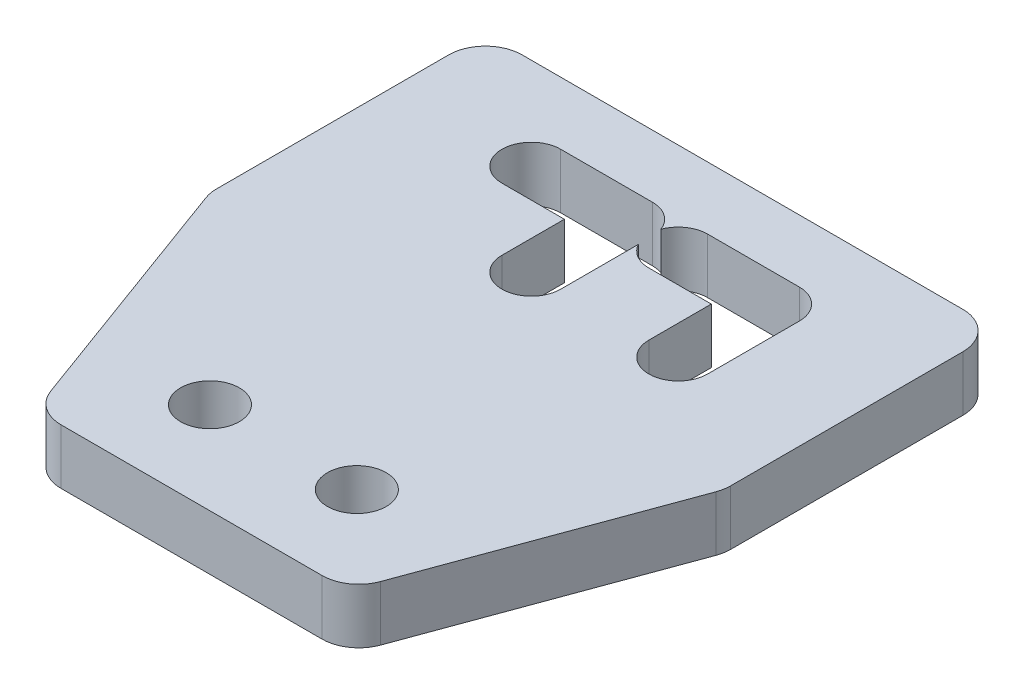
ISO-10303-21;
HEADER;
FILE_DESCRIPTION(('STEP AP214'),'2;1');
FILE_NAME('part.step','',(''),(''),'','','');
FILE_SCHEMA(('AUTOMOTIVE_DESIGN { 1 0 10303 214 1 1 1 1 }'));
ENDSEC;
DATA;
#1=APPLICATION_CONTEXT('core data for automotive mechanical design processes');
#2=APPLICATION_PROTOCOL_DEFINITION('international standard','automotive_design',2000,#1);
#3=PRODUCT_CONTEXT('',#1,'mechanical');
#4=PRODUCT('Part','Part','',(#3));
#5=PRODUCT_RELATED_PRODUCT_CATEGORY('part','',(#4));
#6=PRODUCT_DEFINITION_FORMATION('','',#4);
#7=PRODUCT_DEFINITION_CONTEXT('part definition',#1,'design');
#8=PRODUCT_DEFINITION('design','',#6,#7);
#9=PRODUCT_DEFINITION_SHAPE('','',#8);
#10=(LENGTH_UNIT() NAMED_UNIT(*) SI_UNIT(.MILLI.,.METRE.));
#11=(NAMED_UNIT(*) PLANE_ANGLE_UNIT() SI_UNIT($,.RADIAN.));
#12=(NAMED_UNIT(*) SI_UNIT($,.STERADIAN.) SOLID_ANGLE_UNIT());
#13=UNCERTAINTY_MEASURE_WITH_UNIT(LENGTH_MEASURE(1.E-05),#10,'distance_accuracy_value','');
#14=(GEOMETRIC_REPRESENTATION_CONTEXT(3) GLOBAL_UNCERTAINTY_ASSIGNED_CONTEXT((#13)) GLOBAL_UNIT_ASSIGNED_CONTEXT((#10,
#11,#12)) REPRESENTATION_CONTEXT('',''));
#15=CARTESIAN_POINT('',(0.,0.,0.));
#16=DIRECTION('',(0.,0.,1.));
#17=DIRECTION('',(1.,0.,0.));
#18=AXIS2_PLACEMENT_3D('',#15,#16,#17);
#19=CARTESIAN_POINT('',(0.,3.,15.));
#20=DIRECTION('',(0.,0.,-1.));
#21=DIRECTION('',(-1.,0.,0.));
#22=AXIS2_PLACEMENT_3D('',#19,#20,#21);
#23=PLANE('',#22);
#24=DIRECTION('',(1.,0.,0.));
#25=VECTOR('',#24,1.);
#26=CARTESIAN_POINT('',(0.,0.,15.));
#27=LINE('',#26,#25);
#28=CARTESIAN_POINT('',(-7.10312729217727,0.,15.));
#29=VERTEX_POINT('',#28);
#30=CARTESIAN_POINT('',(7.10312729217727,0.,15.));
#31=VERTEX_POINT('',#30);
#32=EDGE_CURVE('E329',#29,#31,#27,.T.);
#33=ORIENTED_EDGE('',*,*,#32,.T.);
#34=DIRECTION('',(0.,1.,0.));
#35=VECTOR('',#34,1.);
#36=CARTESIAN_POINT('',(7.10312729217727,3.,15.));
#37=LINE('',#36,#35);
#38=CARTESIAN_POINT('',(7.10312729217727,3.,15.));
#39=VERTEX_POINT('',#38);
#40=EDGE_CURVE('E403',#31,#39,#37,.T.);
#41=ORIENTED_EDGE('',*,*,#40,.T.);
#42=DIRECTION('',(1.,0.,0.));
#43=VECTOR('',#42,1.);
#44=CARTESIAN_POINT('',(0.,3.,15.));
#45=LINE('',#44,#43);
#46=CARTESIAN_POINT('',(-7.10312729217727,3.,15.));
#47=VERTEX_POINT('',#46);
#48=EDGE_CURVE('E276',#47,#39,#45,.T.);
#49=ORIENTED_EDGE('',*,*,#48,.F.);
#50=DIRECTION('',(0.,1.,0.));
#51=VECTOR('',#50,1.);
#52=CARTESIAN_POINT('',(-7.10312729217727,3.,15.));
#53=LINE('',#52,#51);
#54=EDGE_CURVE('E401',#47,#29,#53,.F.);
#55=ORIENTED_EDGE('',*,*,#54,.T.);
#56=EDGE_LOOP('',(#33,#41,#49,#55));
#57=FACE_BOUND('',#56,.T.);
#58=ADVANCED_FACE('F35',(#57),#23,.F.);
#59=CARTESIAN_POINT('',(14.,3.,0.));
#60=DIRECTION('',(-1.,0.,0.));
#61=DIRECTION('',(0.,0.,1.));
#62=AXIS2_PLACEMENT_3D('',#59,#60,#61);
#63=PLANE('',#62);
#64=DIRECTION('',(0.,0.,-1.));
#65=VECTOR('',#64,1.);
#66=CARTESIAN_POINT('',(14.,0.,0.));
#67=LINE('',#66,#65);
#68=CARTESIAN_POINT('',(14.,0.,-0.355107384971075));
#69=VERTEX_POINT('',#68);
#70=CARTESIAN_POINT('',(14.,0.,-13.));
#71=VERTEX_POINT('',#70);
#72=EDGE_CURVE('E332',#69,#71,#67,.T.);
#73=ORIENTED_EDGE('',*,*,#72,.T.);
#74=DIRECTION('',(0.,-1.,0.));
#75=VECTOR('',#74,1.);
#76=CARTESIAN_POINT('',(14.,3.,-13.));
#77=LINE('',#76,#75);
#78=CARTESIAN_POINT('',(14.,3.,-13.));
#79=VERTEX_POINT('',#78);
#80=EDGE_CURVE('E384',#71,#79,#77,.F.);
#81=ORIENTED_EDGE('',*,*,#80,.T.);
#82=DIRECTION('',(0.,0.,-1.));
#83=VECTOR('',#82,1.);
#84=CARTESIAN_POINT('',(14.,3.,0.));
#85=LINE('',#84,#83);
#86=CARTESIAN_POINT('',(14.,3.,-0.355107384971075));
#87=VERTEX_POINT('',#86);
#88=EDGE_CURVE('E279',#87,#79,#85,.T.);
#89=ORIENTED_EDGE('',*,*,#88,.F.);
#90=DIRECTION('',(0.,1.,0.));
#91=VECTOR('',#90,1.);
#92=CARTESIAN_POINT('',(14.,3.,-0.355107384971075));
#93=LINE('',#92,#91);
#94=EDGE_CURVE('E382',#87,#69,#93,.F.);
#95=ORIENTED_EDGE('',*,*,#94,.T.);
#96=EDGE_LOOP('',(#73,#81,#89,#95));
#97=FACE_BOUND('',#96,.T.);
#98=ADVANCED_FACE('F465',(#97),#63,.F.);
#99=CARTESIAN_POINT('',(0.,3.,-15.));
#100=DIRECTION('',(0.,0.,-1.));
#101=DIRECTION('',(-1.,0.,0.));
#102=AXIS2_PLACEMENT_3D('',#99,#100,#101);
#103=PLANE('',#102);
#104=DIRECTION('',(1.,0.,0.));
#105=VECTOR('',#104,1.);
#106=CARTESIAN_POINT('',(0.,3.,-15.));
#107=LINE('',#106,#105);
#108=CARTESIAN_POINT('',(-12.,3.,-15.));
#109=VERTEX_POINT('',#108);
#110=CARTESIAN_POINT('',(12.,3.,-15.));
#111=VERTEX_POINT('',#110);
#112=EDGE_CURVE('E282',#109,#111,#107,.T.);
#113=ORIENTED_EDGE('',*,*,#112,.T.);
#114=DIRECTION('',(0.,-1.,0.));
#115=VECTOR('',#114,1.);
#116=CARTESIAN_POINT('',(12.,0.,-15.));
#117=LINE('',#116,#115);
#118=CARTESIAN_POINT('',(12.,0.,-15.));
#119=VERTEX_POINT('',#118);
#120=EDGE_CURVE('E367',#111,#119,#117,.T.);
#121=ORIENTED_EDGE('',*,*,#120,.T.);
#122=DIRECTION('',(1.,0.,0.));
#123=VECTOR('',#122,1.);
#124=CARTESIAN_POINT('',(0.,0.,-15.));
#125=LINE('',#124,#123);
#126=CARTESIAN_POINT('',(-12.,0.,-15.));
#127=VERTEX_POINT('',#126);
#128=EDGE_CURVE('E335',#127,#119,#125,.T.);
#129=ORIENTED_EDGE('',*,*,#128,.F.);
#130=DIRECTION('',(0.,-1.,0.));
#131=VECTOR('',#130,1.);
#132=CARTESIAN_POINT('',(-12.,3.,-15.));
#133=LINE('',#132,#131);
#134=EDGE_CURVE('E226',#127,#109,#133,.F.);
#135=ORIENTED_EDGE('',*,*,#134,.T.);
#136=EDGE_LOOP('',(#113,#121,#129,#135));
#137=FACE_BOUND('',#136,.T.);
#138=ADVANCED_FACE('F471',(#137),#103,.T.);
#139=CARTESIAN_POINT('',(-6.5,3.,-10.));
#140=DIRECTION('',(0.,-1.,0.));
#141=DIRECTION('',(0.,0.,-1.));
#142=AXIS2_PLACEMENT_3D('',#139,#140,#141);
#143=CYLINDRICAL_SURFACE('',#142,1.6);
#144=CARTESIAN_POINT('',(-6.5,0.,-10.));
#145=DIRECTION('',(0.,1.,0.));
#146=DIRECTION('',(0.,0.,1.));
#147=AXIS2_PLACEMENT_3D('',#144,#145,#146);
#148=CIRCLE('',#147,1.6);
#149=CARTESIAN_POINT('',(-6.5,0.,-11.6));
#150=VERTEX_POINT('',#149);
#151=CARTESIAN_POINT('',(-6.5,0.,-8.4));
#152=VERTEX_POINT('',#151);
#153=EDGE_CURVE('E221',#150,#152,#148,.T.);
#154=ORIENTED_EDGE('',*,*,#153,.F.);
#155=DIRECTION('',(0.,-1.,0.));
#156=VECTOR('',#155,1.);
#157=CARTESIAN_POINT('',(-6.5,3.,-11.6));
#158=LINE('',#157,#156);
#159=CARTESIAN_POINT('',(-6.5,3.,-11.6));
#160=VERTEX_POINT('',#159);
#161=EDGE_CURVE('E216',#160,#150,#158,.T.);
#162=ORIENTED_EDGE('',*,*,#161,.F.);
#163=CARTESIAN_POINT('',(-6.5,3.,-10.));
#164=DIRECTION('',(0.,1.,0.));
#165=DIRECTION('',(0.,0.,1.));
#166=AXIS2_PLACEMENT_3D('',#163,#164,#165);
#167=CIRCLE('',#166,1.6);
#168=CARTESIAN_POINT('',(-6.5,3.,-8.4));
#169=VERTEX_POINT('',#168);
#170=EDGE_CURVE('E219',#160,#169,#167,.T.);
#171=ORIENTED_EDGE('',*,*,#170,.T.);
#172=DIRECTION('',(0.,-1.,0.));
#173=VECTOR('',#172,1.);
#174=CARTESIAN_POINT('',(-6.5,3.,-8.4));
#175=LINE('',#174,#173);
#176=EDGE_CURVE('E287',#169,#152,#175,.T.);
#177=ORIENTED_EDGE('',*,*,#176,.T.);
#178=EDGE_LOOP('',(#154,#162,#171,#177));
#179=FACE_BOUND('',#178,.T.);
#180=ADVANCED_FACE('F218',(#179),#143,.F.);
#181=CARTESIAN_POINT('',(0.,3.,-11.6));
#182=DIRECTION('',(0.,0.,1.));
#183=DIRECTION('',(1.,0.,0.));
#184=AXIS2_PLACEMENT_3D('',#181,#182,#183);
#185=PLANE('',#184);
#186=DIRECTION('',(-1.,0.,0.));
#187=VECTOR('',#186,1.);
#188=CARTESIAN_POINT('',(0.,0.,-11.6));
#189=LINE('',#188,#187);
#190=CARTESIAN_POINT('',(-1.5,0.,-11.6));
#191=VERTEX_POINT('',#190);
#192=EDGE_CURVE('E289',#191,#150,#189,.T.);
#193=ORIENTED_EDGE('',*,*,#192,.F.);
#194=DIRECTION('',(0.,-1.,0.));
#195=VECTOR('',#194,1.);
#196=CARTESIAN_POINT('',(-1.5,3.,-11.6));
#197=LINE('',#196,#195);
#198=CARTESIAN_POINT('',(-1.5,3.,-11.6));
#199=VERTEX_POINT('',#198);
#200=EDGE_CURVE('E227',#199,#191,#197,.T.);
#201=ORIENTED_EDGE('',*,*,#200,.F.);
#202=DIRECTION('',(-1.,0.,0.));
#203=VECTOR('',#202,1.);
#204=CARTESIAN_POINT('',(0.,3.,-11.6));
#205=LINE('',#204,#203);
#206=EDGE_CURVE('E233',#199,#160,#205,.T.);
#207=ORIENTED_EDGE('',*,*,#206,.T.);
#208=ORIENTED_EDGE('',*,*,#161,.T.);
#209=EDGE_LOOP('',(#193,#201,#207,#208));
#210=FACE_BOUND('',#209,.T.);
#211=ADVANCED_FACE('F241',(#210),#185,.T.);
#212=CARTESIAN_POINT('',(-1.5,3.,-10.));
#213=DIRECTION('',(0.,-1.,0.));
#214=DIRECTION('',(0.,0.,-1.));
#215=AXIS2_PLACEMENT_3D('',#212,#213,#214);
#216=CYLINDRICAL_SURFACE('',#215,1.6);
#217=CARTESIAN_POINT('',(-1.5,0.,-10.));
#218=DIRECTION('',(0.,1.,0.));
#219=DIRECTION('',(0.,0.,1.));
#220=AXIS2_PLACEMENT_3D('',#217,#218,#219);
#221=CIRCLE('',#220,1.6);
#222=CARTESIAN_POINT('',(0.,0.,-10.556776436283));
#223=VERTEX_POINT('',#222);
#224=EDGE_CURVE('E292',#223,#191,#221,.T.);
#225=ORIENTED_EDGE('',*,*,#224,.F.);
#226=DIRECTION('',(0.,-1.,0.));
#227=VECTOR('',#226,1.);
#228=CARTESIAN_POINT('',(0.,3.,-10.556776436283));
#229=LINE('',#228,#227);
#230=CARTESIAN_POINT('',(0.,3.,-10.556776436283));
#231=VERTEX_POINT('',#230);
#232=EDGE_CURVE('E363',#231,#223,#229,.T.);
#233=ORIENTED_EDGE('',*,*,#232,.F.);
#234=CARTESIAN_POINT('',(-1.5,3.,-10.));
#235=DIRECTION('',(0.,1.,0.));
#236=DIRECTION('',(0.,0.,1.));
#237=AXIS2_PLACEMENT_3D('',#234,#235,#236);
#238=CIRCLE('',#237,1.6);
#239=EDGE_CURVE('E242',#231,#199,#238,.T.);
#240=ORIENTED_EDGE('',*,*,#239,.T.);
#241=ORIENTED_EDGE('',*,*,#200,.T.);
#242=EDGE_LOOP('',(#225,#233,#240,#241));
#243=FACE_BOUND('',#242,.T.);
#244=ADVANCED_FACE('F520',(#243),#216,.F.);
#245=CARTESIAN_POINT('',(1.5,3.,-10.));
#246=DIRECTION('',(0.,-1.,0.));
#247=DIRECTION('',(0.,0.,-1.));
#248=AXIS2_PLACEMENT_3D('',#245,#246,#247);
#249=CYLINDRICAL_SURFACE('',#248,1.6);
#250=CARTESIAN_POINT('',(1.5,0.,-10.));
#251=DIRECTION('',(0.,1.,0.));
#252=DIRECTION('',(0.,0.,1.));
#253=AXIS2_PLACEMENT_3D('',#250,#251,#252);
#254=CIRCLE('',#253,1.6);
#255=CARTESIAN_POINT('',(1.5,0.,-11.6));
#256=VERTEX_POINT('',#255);
#257=EDGE_CURVE('E295',#256,#223,#254,.T.);
#258=ORIENTED_EDGE('',*,*,#257,.F.);
#259=DIRECTION('',(0.,-1.,0.));
#260=VECTOR('',#259,1.);
#261=CARTESIAN_POINT('',(1.5,3.,-11.6));
#262=LINE('',#261,#260);
#263=CARTESIAN_POINT('',(1.5,3.,-11.6));
#264=VERTEX_POINT('',#263);
#265=EDGE_CURVE('E361',#264,#256,#262,.T.);
#266=ORIENTED_EDGE('',*,*,#265,.F.);
#267=CARTESIAN_POINT('',(1.5,3.,-10.));
#268=DIRECTION('',(0.,1.,0.));
#269=DIRECTION('',(0.,0.,1.));
#270=AXIS2_PLACEMENT_3D('',#267,#268,#269);
#271=CIRCLE('',#270,1.6);
#272=EDGE_CURVE('E244',#264,#231,#271,.T.);
#273=ORIENTED_EDGE('',*,*,#272,.T.);
#274=ORIENTED_EDGE('',*,*,#232,.T.);
#275=EDGE_LOOP('',(#258,#266,#273,#274));
#276=FACE_BOUND('',#275,.T.);
#277=ADVANCED_FACE('F496',(#276),#249,.F.);
#278=CARTESIAN_POINT('',(0.,3.,-11.6));
#279=DIRECTION('',(0.,0.,1.));
#280=DIRECTION('',(1.,0.,0.));
#281=AXIS2_PLACEMENT_3D('',#278,#279,#280);
#282=PLANE('',#281);
#283=DIRECTION('',(-1.,0.,0.));
#284=VECTOR('',#283,1.);
#285=CARTESIAN_POINT('',(0.,0.,-11.6));
#286=LINE('',#285,#284);
#287=CARTESIAN_POINT('',(6.5,0.,-11.6));
#288=VERTEX_POINT('',#287);
#289=EDGE_CURVE('E298',#288,#256,#286,.T.);
#290=ORIENTED_EDGE('',*,*,#289,.F.);
#291=DIRECTION('',(0.,-1.,0.));
#292=VECTOR('',#291,1.);
#293=CARTESIAN_POINT('',(6.5,3.,-11.6));
#294=LINE('',#293,#292);
#295=CARTESIAN_POINT('',(6.5,3.,-11.6));
#296=VERTEX_POINT('',#295);
#297=EDGE_CURVE('E359',#296,#288,#294,.T.);
#298=ORIENTED_EDGE('',*,*,#297,.F.);
#299=DIRECTION('',(-1.,0.,0.));
#300=VECTOR('',#299,1.);
#301=CARTESIAN_POINT('',(0.,3.,-11.6));
#302=LINE('',#301,#300);
#303=EDGE_CURVE('E250',#296,#264,#302,.T.);
#304=ORIENTED_EDGE('',*,*,#303,.T.);
#305=ORIENTED_EDGE('',*,*,#265,.T.);
#306=EDGE_LOOP('',(#290,#298,#304,#305));
#307=FACE_BOUND('',#306,.T.);
#308=ADVANCED_FACE('F515',(#307),#282,.T.);
#309=CARTESIAN_POINT('',(6.5,3.,-10.));
#310=DIRECTION('',(0.,-1.,0.));
#311=DIRECTION('',(0.,0.,-1.));
#312=AXIS2_PLACEMENT_3D('',#309,#310,#311);
#313=CYLINDRICAL_SURFACE('',#312,1.6);
#314=CARTESIAN_POINT('',(6.5,0.,-10.));
#315=DIRECTION('',(0.,1.,0.));
#316=DIRECTION('',(0.,0.,1.));
#317=AXIS2_PLACEMENT_3D('',#314,#315,#316);
#318=CIRCLE('',#317,1.6);
#319=CARTESIAN_POINT('',(8.1,0.,-10.));
#320=VERTEX_POINT('',#319);
#321=EDGE_CURVE('E302',#320,#288,#318,.T.);
#322=ORIENTED_EDGE('',*,*,#321,.F.);
#323=DIRECTION('',(0.,-1.,0.));
#324=VECTOR('',#323,1.);
#325=CARTESIAN_POINT('',(8.1,3.,-10.));
#326=LINE('',#325,#324);
#327=CARTESIAN_POINT('',(8.1,3.,-10.));
#328=VERTEX_POINT('',#327);
#329=EDGE_CURVE('E357',#328,#320,#326,.T.);
#330=ORIENTED_EDGE('',*,*,#329,.F.);
#331=CARTESIAN_POINT('',(6.5,3.,-10.));
#332=DIRECTION('',(0.,1.,0.));
#333=DIRECTION('',(0.,0.,1.));
#334=AXIS2_PLACEMENT_3D('',#331,#332,#333);
#335=CIRCLE('',#334,1.6);
#336=EDGE_CURVE('E254',#328,#296,#335,.T.);
#337=ORIENTED_EDGE('',*,*,#336,.T.);
#338=ORIENTED_EDGE('',*,*,#297,.T.);
#339=EDGE_LOOP('',(#322,#330,#337,#338));
#340=FACE_BOUND('',#339,.T.);
#341=ADVANCED_FACE('F511',(#340),#313,.F.);
#342=CARTESIAN_POINT('',(8.10000000000001,3.,0.));
#343=DIRECTION('',(1.,0.,0.));
#344=DIRECTION('',(0.,0.,-1.));
#345=AXIS2_PLACEMENT_3D('',#342,#343,#344);
#346=PLANE('',#345);
#347=DIRECTION('',(0.,0.,1.));
#348=VECTOR('',#347,1.);
#349=CARTESIAN_POINT('',(8.10000000000001,0.,0.));
#350=LINE('',#349,#348);
#351=CARTESIAN_POINT('',(8.1,0.,-5.));
#352=VERTEX_POINT('',#351);
#353=EDGE_CURVE('E305',#320,#352,#350,.T.);
#354=ORIENTED_EDGE('',*,*,#353,.T.);
#355=DIRECTION('',(0.,-1.,0.));
#356=VECTOR('',#355,1.);
#357=CARTESIAN_POINT('',(8.1,3.,-5.));
#358=LINE('',#357,#356);
#359=CARTESIAN_POINT('',(8.1,3.,-5.));
#360=VERTEX_POINT('',#359);
#361=EDGE_CURVE('E355',#360,#352,#358,.T.);
#362=ORIENTED_EDGE('',*,*,#361,.F.);
#363=DIRECTION('',(0.,0.,1.));
#364=VECTOR('',#363,1.);
#365=CARTESIAN_POINT('',(8.10000000000001,3.,0.));
#366=LINE('',#365,#364);
#367=EDGE_CURVE('E257',#328,#360,#366,.T.);
#368=ORIENTED_EDGE('',*,*,#367,.F.);
#369=ORIENTED_EDGE('',*,*,#329,.T.);
#370=EDGE_LOOP('',(#354,#362,#368,#369));
#371=FACE_BOUND('',#370,.T.);
#372=ADVANCED_FACE('F507',(#371),#346,.F.);
#373=CARTESIAN_POINT('',(6.5,3.,-5.));
#374=DIRECTION('',(0.,-1.,0.));
#375=DIRECTION('',(0.,0.,-1.));
#376=AXIS2_PLACEMENT_3D('',#373,#374,#375);
#377=CYLINDRICAL_SURFACE('',#376,1.6);
#378=CARTESIAN_POINT('',(6.5,0.,-5.));
#379=DIRECTION('',(0.,1.,0.));
#380=DIRECTION('',(0.,0.,1.));
#381=AXIS2_PLACEMENT_3D('',#378,#379,#380);
#382=CIRCLE('',#381,1.6);
#383=CARTESIAN_POINT('',(4.9,0.,-5.));
#384=VERTEX_POINT('',#383);
#385=EDGE_CURVE('E308',#384,#352,#382,.T.);
#386=ORIENTED_EDGE('',*,*,#385,.F.);
#387=DIRECTION('',(0.,-1.,0.));
#388=VECTOR('',#387,1.);
#389=CARTESIAN_POINT('',(4.9,3.,-5.));
#390=LINE('',#389,#388);
#391=CARTESIAN_POINT('',(4.9,3.,-5.));
#392=VERTEX_POINT('',#391);
#393=EDGE_CURVE('E353',#392,#384,#390,.T.);
#394=ORIENTED_EDGE('',*,*,#393,.F.);
#395=CARTESIAN_POINT('',(6.5,3.,-5.));
#396=DIRECTION('',(0.,1.,0.));
#397=DIRECTION('',(0.,0.,1.));
#398=AXIS2_PLACEMENT_3D('',#395,#396,#397);
#399=CIRCLE('',#398,1.6);
#400=EDGE_CURVE('E259',#392,#360,#399,.T.);
#401=ORIENTED_EDGE('',*,*,#400,.T.);
#402=ORIENTED_EDGE('',*,*,#361,.T.);
#403=EDGE_LOOP('',(#386,#394,#401,#402));
#404=FACE_BOUND('',#403,.T.);
#405=ADVANCED_FACE('F503',(#404),#377,.F.);
#406=CARTESIAN_POINT('',(4.9,3.,0.));
#407=DIRECTION('',(1.,0.,0.));
#408=DIRECTION('',(0.,0.,-1.));
#409=AXIS2_PLACEMENT_3D('',#406,#407,#408);
#410=PLANE('',#409);
#411=DIRECTION('',(0.,0.,1.));
#412=VECTOR('',#411,1.);
#413=CARTESIAN_POINT('',(4.9,0.,0.));
#414=LINE('',#413,#412);
#415=CARTESIAN_POINT('',(4.9,0.,-8.4));
#416=VERTEX_POINT('',#415);
#417=EDGE_CURVE('E311',#416,#384,#414,.T.);
#418=ORIENTED_EDGE('',*,*,#417,.F.);
#419=DIRECTION('',(0.,-1.,0.));
#420=VECTOR('',#419,1.);
#421=CARTESIAN_POINT('',(4.9,3.,-8.4));
#422=LINE('',#421,#420);
#423=CARTESIAN_POINT('',(4.9,3.,-8.4));
#424=VERTEX_POINT('',#423);
#425=EDGE_CURVE('E351',#424,#416,#422,.T.);
#426=ORIENTED_EDGE('',*,*,#425,.F.);
#427=DIRECTION('',(0.,0.,1.));
#428=VECTOR('',#427,1.);
#429=CARTESIAN_POINT('',(4.9,3.,0.));
#430=LINE('',#429,#428);
#431=EDGE_CURVE('E262',#424,#392,#430,.T.);
#432=ORIENTED_EDGE('',*,*,#431,.T.);
#433=ORIENTED_EDGE('',*,*,#393,.T.);
#434=EDGE_LOOP('',(#418,#426,#432,#433));
#435=FACE_BOUND('',#434,.T.);
#436=ADVANCED_FACE('F499',(#435),#410,.T.);
#437=CARTESIAN_POINT('',(0.,3.,-8.4));
#438=DIRECTION('',(0.,0.,1.));
#439=DIRECTION('',(1.,0.,0.));
#440=AXIS2_PLACEMENT_3D('',#437,#438,#439);
#441=PLANE('',#440);
#442=DIRECTION('',(-1.,0.,0.));
#443=VECTOR('',#442,1.);
#444=CARTESIAN_POINT('',(0.,0.,-8.4));
#445=LINE('',#444,#443);
#446=CARTESIAN_POINT('',(1.5,0.,-8.4));
#447=VERTEX_POINT('',#446);
#448=EDGE_CURVE('E314',#416,#447,#445,.T.);
#449=ORIENTED_EDGE('',*,*,#448,.T.);
#450=DIRECTION('',(0.,-1.,0.));
#451=VECTOR('',#450,1.);
#452=CARTESIAN_POINT('',(1.5,3.,-8.4));
#453=LINE('',#452,#451);
#454=CARTESIAN_POINT('',(1.5,3.,-8.4));
#455=VERTEX_POINT('',#454);
#456=EDGE_CURVE('E349',#455,#447,#453,.T.);
#457=ORIENTED_EDGE('',*,*,#456,.F.);
#458=DIRECTION('',(-1.,0.,0.));
#459=VECTOR('',#458,1.);
#460=CARTESIAN_POINT('',(0.,3.,-8.4));
#461=LINE('',#460,#459);
#462=EDGE_CURVE('E265',#424,#455,#461,.T.);
#463=ORIENTED_EDGE('',*,*,#462,.F.);
#464=ORIENTED_EDGE('',*,*,#425,.T.);
#465=EDGE_LOOP('',(#449,#457,#463,#464));
#466=FACE_BOUND('',#465,.T.);
#467=ADVANCED_FACE('F494',(#466),#441,.F.);
#468=CARTESIAN_POINT('',(0.100000000000003,0.,-9.22540333075851));
#469=VERTEX_POINT('',#468);
#470=EDGE_CURVE('E299',#469,#447,#254,.T.);
#471=ORIENTED_EDGE('',*,*,#470,.F.);
#472=DIRECTION('',(0.,-1.,0.));
#473=VECTOR('',#472,1.);
#474=CARTESIAN_POINT('',(0.100000000000003,3.,-9.22540333075851));
#475=LINE('',#474,#473);
#476=CARTESIAN_POINT('',(0.100000000000003,3.,-9.22540333075851));
#477=VERTEX_POINT('',#476);
#478=EDGE_CURVE('E347',#477,#469,#475,.T.);
#479=ORIENTED_EDGE('',*,*,#478,.F.);
#480=EDGE_CURVE('E251',#477,#455,#271,.T.);
#481=ORIENTED_EDGE('',*,*,#480,.T.);
#482=ORIENTED_EDGE('',*,*,#456,.T.);
#483=EDGE_LOOP('',(#471,#479,#481,#482));
#484=FACE_BOUND('',#483,.T.);
#485=ADVANCED_FACE('F490',(#484),#249,.F.);
#486=CARTESIAN_POINT('',(0.100000000000004,3.,0.));
#487=DIRECTION('',(1.,0.,0.));
#488=DIRECTION('',(0.,0.,-1.));
#489=AXIS2_PLACEMENT_3D('',#486,#487,#488);
#490=PLANE('',#489);
#491=DIRECTION('',(0.,0.,1.));
#492=VECTOR('',#491,1.);
#493=CARTESIAN_POINT('',(0.100000000000004,0.,0.));
#494=LINE('',#493,#492);
#495=CARTESIAN_POINT('',(0.100000000000003,0.,-5.));
#496=VERTEX_POINT('',#495);
#497=EDGE_CURVE('E317',#469,#496,#494,.T.);
#498=ORIENTED_EDGE('',*,*,#497,.T.);
#499=DIRECTION('',(0.,-1.,0.));
#500=VECTOR('',#499,1.);
#501=CARTESIAN_POINT('',(0.100000000000003,3.,-5.));
#502=LINE('',#501,#500);
#503=CARTESIAN_POINT('',(0.100000000000003,3.,-5.));
#504=VERTEX_POINT('',#503);
#505=EDGE_CURVE('E345',#504,#496,#502,.T.);
#506=ORIENTED_EDGE('',*,*,#505,.F.);
#507=DIRECTION('',(0.,0.,1.));
#508=VECTOR('',#507,1.);
#509=CARTESIAN_POINT('',(0.100000000000004,3.,0.));
#510=LINE('',#509,#508);
#511=EDGE_CURVE('E267',#477,#504,#510,.T.);
#512=ORIENTED_EDGE('',*,*,#511,.F.);
#513=ORIENTED_EDGE('',*,*,#478,.T.);
#514=EDGE_LOOP('',(#498,#506,#512,#513));
#515=FACE_BOUND('',#514,.T.);
#516=ADVANCED_FACE('F486',(#515),#490,.F.);
#517=CARTESIAN_POINT('',(-1.5,3.,-5.));
#518=DIRECTION('',(0.,-1.,0.));
#519=DIRECTION('',(0.,0.,-1.));
#520=AXIS2_PLACEMENT_3D('',#517,#518,#519);
#521=CYLINDRICAL_SURFACE('',#520,1.6);
#522=CARTESIAN_POINT('',(-1.5,0.,-5.));
#523=DIRECTION('',(0.,1.,0.));
#524=DIRECTION('',(0.,0.,1.));
#525=AXIS2_PLACEMENT_3D('',#522,#523,#524);
#526=CIRCLE('',#525,1.6);
#527=CARTESIAN_POINT('',(-3.1,0.,-5.));
#528=VERTEX_POINT('',#527);
#529=EDGE_CURVE('E320',#528,#496,#526,.T.);
#530=ORIENTED_EDGE('',*,*,#529,.F.);
#531=DIRECTION('',(0.,-1.,0.));
#532=VECTOR('',#531,1.);
#533=CARTESIAN_POINT('',(-3.1,3.,-5.));
#534=LINE('',#533,#532);
#535=CARTESIAN_POINT('',(-3.1,3.,-5.));
#536=VERTEX_POINT('',#535);
#537=EDGE_CURVE('E343',#536,#528,#534,.T.);
#538=ORIENTED_EDGE('',*,*,#537,.F.);
#539=CARTESIAN_POINT('',(-1.5,3.,-5.));
#540=DIRECTION('',(0.,1.,0.));
#541=DIRECTION('',(0.,0.,1.));
#542=AXIS2_PLACEMENT_3D('',#539,#540,#541);
#543=CIRCLE('',#542,1.6);
#544=EDGE_CURVE('E269',#536,#504,#543,.T.);
#545=ORIENTED_EDGE('',*,*,#544,.T.);
#546=ORIENTED_EDGE('',*,*,#505,.T.);
#547=EDGE_LOOP('',(#530,#538,#545,#546));
#548=FACE_BOUND('',#547,.T.);
#549=ADVANCED_FACE('F482',(#548),#521,.F.);
#550=CARTESIAN_POINT('',(-3.1,3.,0.));
#551=DIRECTION('',(1.,0.,0.));
#552=DIRECTION('',(0.,0.,-1.));
#553=AXIS2_PLACEMENT_3D('',#550,#551,#552);
#554=PLANE('',#553);
#555=DIRECTION('',(0.,0.,1.));
#556=VECTOR('',#555,1.);
#557=CARTESIAN_POINT('',(-3.1,0.,0.));
#558=LINE('',#557,#556);
#559=CARTESIAN_POINT('',(-3.1,0.,-8.4));
#560=VERTEX_POINT('',#559);
#561=EDGE_CURVE('E323',#560,#528,#558,.T.);
#562=ORIENTED_EDGE('',*,*,#561,.F.);
#563=DIRECTION('',(0.,-1.,0.));
#564=VECTOR('',#563,1.);
#565=CARTESIAN_POINT('',(-3.1,3.,-8.4));
#566=LINE('',#565,#564);
#567=CARTESIAN_POINT('',(-3.1,3.,-8.4));
#568=VERTEX_POINT('',#567);
#569=EDGE_CURVE('E341',#568,#560,#566,.T.);
#570=ORIENTED_EDGE('',*,*,#569,.F.);
#571=DIRECTION('',(0.,0.,1.));
#572=VECTOR('',#571,1.);
#573=CARTESIAN_POINT('',(-3.1,3.,0.));
#574=LINE('',#573,#572);
#575=EDGE_CURVE('E272',#568,#536,#574,.T.);
#576=ORIENTED_EDGE('',*,*,#575,.T.);
#577=ORIENTED_EDGE('',*,*,#537,.T.);
#578=EDGE_LOOP('',(#562,#570,#576,#577));
#579=FACE_BOUND('',#578,.T.);
#580=ADVANCED_FACE('F478',(#579),#554,.T.);
#581=CARTESIAN_POINT('',(0.,3.,-8.4));
#582=DIRECTION('',(0.,0.,1.));
#583=DIRECTION('',(1.,0.,0.));
#584=AXIS2_PLACEMENT_3D('',#581,#582,#583);
#585=PLANE('',#584);
#586=DIRECTION('',(-1.,0.,0.));
#587=VECTOR('',#586,1.);
#588=CARTESIAN_POINT('',(0.,0.,-8.4));
#589=LINE('',#588,#587);
#590=EDGE_CURVE('E326',#560,#152,#589,.T.);
#591=ORIENTED_EDGE('',*,*,#590,.T.);
#592=ORIENTED_EDGE('',*,*,#176,.F.);
#593=DIRECTION('',(-1.,0.,0.));
#594=VECTOR('',#593,1.);
#595=CARTESIAN_POINT('',(0.,3.,-8.4));
#596=LINE('',#595,#594);
#597=EDGE_CURVE('E237',#568,#169,#596,.T.);
#598=ORIENTED_EDGE('',*,*,#597,.F.);
#599=ORIENTED_EDGE('',*,*,#569,.T.);
#600=EDGE_LOOP('',(#591,#592,#598,#599));
#601=FACE_BOUND('',#600,.T.);
#602=ADVANCED_FACE('F461',(#601),#585,.F.);
#603=CARTESIAN_POINT('',(-14.,3.,0.));
#604=DIRECTION('',(-1.,0.,0.));
#605=DIRECTION('',(0.,0.,1.));
#606=AXIS2_PLACEMENT_3D('',#603,#604,#605);
#607=PLANE('',#606);
#608=DIRECTION('',(0.,0.,-1.));
#609=VECTOR('',#608,1.);
#610=CARTESIAN_POINT('',(-14.,0.,0.));
#611=LINE('',#610,#609);
#612=CARTESIAN_POINT('',(-14.,0.,-0.355107384971104));
#613=VERTEX_POINT('',#612);
#614=CARTESIAN_POINT('',(-14.,0.,-13.));
#615=VERTEX_POINT('',#614);
#616=EDGE_CURVE('E239',#613,#615,#611,.T.);
#617=ORIENTED_EDGE('',*,*,#616,.F.);
#618=DIRECTION('',(0.,1.,0.));
#619=VECTOR('',#618,1.);
#620=CARTESIAN_POINT('',(-14.,3.,-0.355107384971104));
#621=LINE('',#620,#619);
#622=CARTESIAN_POINT('',(-14.,3.,-0.355107384971104));
#623=VERTEX_POINT('',#622);
#624=EDGE_CURVE('E11',#613,#623,#621,.T.);
#625=ORIENTED_EDGE('',*,*,#624,.T.);
#626=DIRECTION('',(0.,0.,-1.));
#627=VECTOR('',#626,1.);
#628=CARTESIAN_POINT('',(-14.,3.,0.));
#629=LINE('',#628,#627);
#630=CARTESIAN_POINT('',(-14.,3.,-13.));
#631=VERTEX_POINT('',#630);
#632=EDGE_CURVE('E285',#623,#631,#629,.T.);
#633=ORIENTED_EDGE('',*,*,#632,.T.);
#634=DIRECTION('',(0.,-1.,0.));
#635=VECTOR('',#634,1.);
#636=CARTESIAN_POINT('',(-14.,3.,-13.));
#637=LINE('',#636,#635);
#638=EDGE_CURVE('E43',#631,#615,#637,.T.);
#639=ORIENTED_EDGE('',*,*,#638,.T.);
#640=EDGE_LOOP('',(#617,#625,#633,#639));
#641=FACE_BOUND('',#640,.T.);
#642=ADVANCED_FACE('F414',(#641),#607,.T.);
#643=CARTESIAN_POINT('',(0.,3.,0.));
#644=DIRECTION('',(0.,1.,0.));
#645=DIRECTION('',(0.,0.,1.));
#646=AXIS2_PLACEMENT_3D('',#643,#644,#645);
#647=PLANE('',#646);
#648=ORIENTED_EDGE('',*,*,#88,.T.);
#649=CARTESIAN_POINT('',(12.,3.,-13.));
#650=DIRECTION('',(0.,1.,0.));
#651=DIRECTION('',(0.,0.,1.));
#652=AXIS2_PLACEMENT_3D('',#649,#650,#651);
#653=CIRCLE('',#652,2.);
#654=EDGE_CURVE('E394',#79,#111,#653,.T.);
#655=ORIENTED_EDGE('',*,*,#654,.T.);
#656=ORIENTED_EDGE('',*,*,#112,.F.);
#657=CARTESIAN_POINT('',(-12.,3.,-13.));
#658=DIRECTION('',(0.,1.,0.));
#659=DIRECTION('',(0.,0.,1.));
#660=AXIS2_PLACEMENT_3D('',#657,#658,#659);
#661=CIRCLE('',#660,2.);
#662=EDGE_CURVE('E50',#109,#631,#661,.T.);
#663=ORIENTED_EDGE('',*,*,#662,.T.);
#664=ORIENTED_EDGE('',*,*,#632,.F.);
#665=CARTESIAN_POINT('',(-12.,3.,-0.355107384971104));
#666=DIRECTION('',(0.,1.,0.));
#667=DIRECTION('',(0.,0.,1.));
#668=AXIS2_PLACEMENT_3D('',#665,#666,#667);
#669=CIRCLE('',#668,2.);
#670=CARTESIAN_POINT('',(-13.8777526317732,3.,0.333401913345742));
#671=VERTEX_POINT('',#670);
#672=EDGE_CURVE('E58',#623,#671,#669,.T.);
#673=ORIENTED_EDGE('',*,*,#672,.T.);
#674=DIRECTION('',(-0.344254649158423,0.,-0.938876315886609));
#675=VECTOR('',#674,1.);
#676=CARTESIAN_POINT('',(-14.,3.,0.));
#677=LINE('',#676,#675);
#678=CARTESIAN_POINT('',(-8.98087992395049,3.,13.6885092983168));
#679=VERTEX_POINT('',#678);
#680=EDGE_CURVE('E427',#679,#671,#677,.T.);
#681=ORIENTED_EDGE('',*,*,#680,.F.);
#682=CARTESIAN_POINT('',(-7.10312729217727,3.,13.));
#683=DIRECTION('',(0.,1.,0.));
#684=DIRECTION('',(0.,0.,1.));
#685=AXIS2_PLACEMENT_3D('',#682,#683,#684);
#686=CIRCLE('',#685,2.);
#687=EDGE_CURVE('E388',#679,#47,#686,.T.);
#688=ORIENTED_EDGE('',*,*,#687,.T.);
#689=ORIENTED_EDGE('',*,*,#48,.T.);
#690=CARTESIAN_POINT('',(7.10312729217727,3.,13.));
#691=DIRECTION('',(0.,1.,0.));
#692=DIRECTION('',(0.,0.,1.));
#693=AXIS2_PLACEMENT_3D('',#690,#691,#692);
#694=CIRCLE('',#693,2.);
#695=CARTESIAN_POINT('',(8.98087992395049,3.,13.6885092983168));
#696=VERTEX_POINT('',#695);
#697=EDGE_CURVE('E390',#39,#696,#694,.T.);
#698=ORIENTED_EDGE('',*,*,#697,.T.);
#699=DIRECTION('',(-0.344254649158423,0.,0.938876315886608));
#700=VECTOR('',#699,1.);
#701=CARTESIAN_POINT('',(14.,3.,0.));
#702=LINE('',#701,#700);
#703=CARTESIAN_POINT('',(13.8777526317732,3.,0.333401913345772));
#704=VERTEX_POINT('',#703);
#705=EDGE_CURVE('E432',#704,#696,#702,.T.);
#706=ORIENTED_EDGE('',*,*,#705,.F.);
#707=CARTESIAN_POINT('',(12.,3.,-0.355107384971075));
#708=DIRECTION('',(0.,1.,0.));
#709=DIRECTION('',(0.,0.,1.));
#710=AXIS2_PLACEMENT_3D('',#707,#708,#709);
#711=CIRCLE('',#710,2.);
#712=EDGE_CURVE('E392',#704,#87,#711,.T.);
#713=ORIENTED_EDGE('',*,*,#712,.T.);
#714=EDGE_LOOP('',(#648,#655,#656,#663,#664,#673,#681,#688,#689,#698,#706,#713));
#715=FACE_BOUND('',#714,.T.);
#716=CARTESIAN_POINT('',(4.,3.,10.));
#717=DIRECTION('',(0.,1.,0.));
#718=DIRECTION('',(0.,0.,-1.));
#719=AXIS2_PLACEMENT_3D('',#716,#717,#718);
#720=CIRCLE('',#719,1.6);
#721=CARTESIAN_POINT('',(4.,3.,8.4));
#722=VERTEX_POINT('',#721);
#723=EDGE_CURVE('E438',#722,#722,#720,.T.);
#724=ORIENTED_EDGE('',*,*,#723,.F.);
#725=EDGE_LOOP('',(#724));
#726=FACE_BOUND('',#725,.T.);
#727=CARTESIAN_POINT('',(-4.,3.,10.));
#728=DIRECTION('',(0.,1.,0.));
#729=DIRECTION('',(0.,0.,1.));
#730=AXIS2_PLACEMENT_3D('',#727,#728,#729);
#731=CIRCLE('',#730,1.6);
#732=CARTESIAN_POINT('',(-4.,3.,11.6));
#733=VERTEX_POINT('',#732);
#734=EDGE_CURVE('E444',#733,#733,#731,.T.);
#735=ORIENTED_EDGE('',*,*,#734,.F.);
#736=EDGE_LOOP('',(#735));
#737=FACE_BOUND('',#736,.T.);
#738=ORIENTED_EDGE('',*,*,#170,.F.);
#739=ORIENTED_EDGE('',*,*,#206,.F.);
#740=ORIENTED_EDGE('',*,*,#239,.F.);
#741=ORIENTED_EDGE('',*,*,#272,.F.);
#742=ORIENTED_EDGE('',*,*,#303,.F.);
#743=ORIENTED_EDGE('',*,*,#336,.F.);
#744=ORIENTED_EDGE('',*,*,#367,.T.);
#745=ORIENTED_EDGE('',*,*,#400,.F.);
#746=ORIENTED_EDGE('',*,*,#431,.F.);
#747=ORIENTED_EDGE('',*,*,#462,.T.);
#748=ORIENTED_EDGE('',*,*,#480,.F.);
#749=ORIENTED_EDGE('',*,*,#511,.T.);
#750=ORIENTED_EDGE('',*,*,#544,.F.);
#751=ORIENTED_EDGE('',*,*,#575,.F.);
#752=ORIENTED_EDGE('',*,*,#597,.T.);
#753=EDGE_LOOP('',(#738,#739,#740,#741,#742,#743,#744,#745,#746,#747,#748,#749,#750,#751,#752));
#754=FACE_BOUND('',#753,.T.);
#755=ADVANCED_FACE('F231',(#715,#726,#737,#754),#647,.T.);
#756=CARTESIAN_POINT('',(0.,0.,0.));
#757=DIRECTION('',(0.,1.,0.));
#758=DIRECTION('',(0.,0.,1.));
#759=AXIS2_PLACEMENT_3D('',#756,#757,#758);
#760=PLANE('',#759);
#761=CARTESIAN_POINT('',(4.,0.,10.));
#762=DIRECTION('',(0.,1.,0.));
#763=DIRECTION('',(0.,0.,-1.));
#764=AXIS2_PLACEMENT_3D('',#761,#762,#763);
#765=CIRCLE('',#764,1.6);
#766=CARTESIAN_POINT('',(4.,0.,8.4));
#767=VERTEX_POINT('',#766);
#768=EDGE_CURVE('E441',#767,#767,#765,.T.);
#769=ORIENTED_EDGE('',*,*,#768,.T.);
#770=EDGE_LOOP('',(#769));
#771=FACE_BOUND('',#770,.T.);
#772=CARTESIAN_POINT('',(-4.,0.,10.));
#773=DIRECTION('',(0.,1.,0.));
#774=DIRECTION('',(0.,0.,1.));
#775=AXIS2_PLACEMENT_3D('',#772,#773,#774);
#776=CIRCLE('',#775,1.6);
#777=CARTESIAN_POINT('',(-4.,0.,11.6));
#778=VERTEX_POINT('',#777);
#779=EDGE_CURVE('E290',#778,#778,#776,.T.);
#780=ORIENTED_EDGE('',*,*,#779,.T.);
#781=EDGE_LOOP('',(#780));
#782=FACE_BOUND('',#781,.T.);
#783=ORIENTED_EDGE('',*,*,#153,.T.);
#784=ORIENTED_EDGE('',*,*,#590,.F.);
#785=ORIENTED_EDGE('',*,*,#561,.T.);
#786=ORIENTED_EDGE('',*,*,#529,.T.);
#787=ORIENTED_EDGE('',*,*,#497,.F.);
#788=ORIENTED_EDGE('',*,*,#470,.T.);
#789=ORIENTED_EDGE('',*,*,#448,.F.);
#790=ORIENTED_EDGE('',*,*,#417,.T.);
#791=ORIENTED_EDGE('',*,*,#385,.T.);
#792=ORIENTED_EDGE('',*,*,#353,.F.);
#793=ORIENTED_EDGE('',*,*,#321,.T.);
#794=ORIENTED_EDGE('',*,*,#289,.T.);
#795=ORIENTED_EDGE('',*,*,#257,.T.);
#796=ORIENTED_EDGE('',*,*,#224,.T.);
#797=ORIENTED_EDGE('',*,*,#192,.T.);
#798=EDGE_LOOP('',(#783,#784,#785,#786,#787,#788,#789,#790,#791,#792,#793,#794,#795,#796,#797));
#799=FACE_BOUND('',#798,.T.);
#800=ORIENTED_EDGE('',*,*,#128,.T.);
#801=CARTESIAN_POINT('',(12.,0.,-13.));
#802=DIRECTION('',(0.,1.,0.));
#803=DIRECTION('',(0.,0.,1.));
#804=AXIS2_PLACEMENT_3D('',#801,#802,#803);
#805=CIRCLE('',#804,2.);
#806=EDGE_CURVE('E380',#119,#71,#805,.F.);
#807=ORIENTED_EDGE('',*,*,#806,.T.);
#808=ORIENTED_EDGE('',*,*,#72,.F.);
#809=CARTESIAN_POINT('',(12.,0.,-0.355107384971075));
#810=DIRECTION('',(0.,1.,0.));
#811=DIRECTION('',(0.,0.,1.));
#812=AXIS2_PLACEMENT_3D('',#809,#810,#811);
#813=CIRCLE('',#812,2.);
#814=CARTESIAN_POINT('',(13.8777526317732,0.,0.333401913345772));
#815=VERTEX_POINT('',#814);
#816=EDGE_CURVE('E378',#69,#815,#813,.F.);
#817=ORIENTED_EDGE('',*,*,#816,.T.);
#818=DIRECTION('',(-0.344254649158423,0.,0.938876315886608));
#819=VECTOR('',#818,1.);
#820=CARTESIAN_POINT('',(14.,0.,0.));
#821=LINE('',#820,#819);
#822=CARTESIAN_POINT('',(8.98087992395049,0.,13.6885092983168));
#823=VERTEX_POINT('',#822);
#824=EDGE_CURVE('E435',#815,#823,#821,.T.);
#825=ORIENTED_EDGE('',*,*,#824,.T.);
#826=CARTESIAN_POINT('',(7.10312729217727,0.,13.));
#827=DIRECTION('',(0.,1.,0.));
#828=DIRECTION('',(0.,0.,1.));
#829=AXIS2_PLACEMENT_3D('',#826,#827,#828);
#830=CIRCLE('',#829,2.);
#831=EDGE_CURVE('E376',#823,#31,#830,.F.);
#832=ORIENTED_EDGE('',*,*,#831,.T.);
#833=ORIENTED_EDGE('',*,*,#32,.F.);
#834=CARTESIAN_POINT('',(-7.10312729217727,0.,13.));
#835=DIRECTION('',(0.,1.,0.));
#836=DIRECTION('',(0.,0.,1.));
#837=AXIS2_PLACEMENT_3D('',#834,#835,#836);
#838=CIRCLE('',#837,2.);
#839=CARTESIAN_POINT('',(-8.98087992395049,0.,13.6885092983168));
#840=VERTEX_POINT('',#839);
#841=EDGE_CURVE('E374',#29,#840,#838,.F.);
#842=ORIENTED_EDGE('',*,*,#841,.T.);
#843=DIRECTION('',(-0.344254649158423,0.,-0.938876315886609));
#844=VECTOR('',#843,1.);
#845=CARTESIAN_POINT('',(-14.,0.,0.));
#846=LINE('',#845,#844);
#847=CARTESIAN_POINT('',(-13.8777526317732,0.,0.333401913345742));
#848=VERTEX_POINT('',#847);
#849=EDGE_CURVE('E422',#840,#848,#846,.T.);
#850=ORIENTED_EDGE('',*,*,#849,.T.);
#851=CARTESIAN_POINT('',(-12.,0.,-0.355107384971104));
#852=DIRECTION('',(0.,1.,0.));
#853=DIRECTION('',(0.,0.,1.));
#854=AXIS2_PLACEMENT_3D('',#851,#852,#853);
#855=CIRCLE('',#854,2.);
#856=EDGE_CURVE('E372',#848,#613,#855,.F.);
#857=ORIENTED_EDGE('',*,*,#856,.T.);
#858=ORIENTED_EDGE('',*,*,#616,.T.);
#859=CARTESIAN_POINT('',(-12.,0.,-13.));
#860=DIRECTION('',(0.,1.,0.));
#861=DIRECTION('',(0.,0.,1.));
#862=AXIS2_PLACEMENT_3D('',#859,#860,#861);
#863=CIRCLE('',#862,2.);
#864=EDGE_CURVE('E370',#615,#127,#863,.F.);
#865=ORIENTED_EDGE('',*,*,#864,.T.);
#866=EDGE_LOOP('',(#800,#807,#808,#817,#825,#832,#833,#842,#850,#857,#858,#865));
#867=FACE_BOUND('',#866,.T.);
#868=ADVANCED_FACE('F417',(#771,#782,#799,#867),#760,.F.);
#869=CARTESIAN_POINT('',(-4.,0.,10.));
#870=DIRECTION('',(0.,1.,0.));
#871=DIRECTION('',(0.,0.,1.));
#872=AXIS2_PLACEMENT_3D('',#869,#870,#871);
#873=CYLINDRICAL_SURFACE('',#872,1.6);
#874=ORIENTED_EDGE('',*,*,#779,.F.);
#875=EDGE_LOOP('',(#874));
#876=FACE_BOUND('',#875,.T.);
#877=ORIENTED_EDGE('',*,*,#734,.T.);
#878=EDGE_LOOP('',(#877));
#879=FACE_BOUND('',#878,.T.);
#880=ADVANCED_FACE('F451',(#876,#879),#873,.F.);
#881=CARTESIAN_POINT('',(4.,0.,10.));
#882=DIRECTION('',(0.,1.,0.));
#883=DIRECTION('',(0.,0.,1.));
#884=AXIS2_PLACEMENT_3D('',#881,#882,#883);
#885=CYLINDRICAL_SURFACE('',#884,1.6);
#886=ORIENTED_EDGE('',*,*,#768,.F.);
#887=EDGE_LOOP('',(#886));
#888=FACE_BOUND('',#887,.T.);
#889=ORIENTED_EDGE('',*,*,#723,.T.);
#890=EDGE_LOOP('',(#889));
#891=FACE_BOUND('',#890,.T.);
#892=ADVANCED_FACE('F571',(#888,#891),#885,.F.);
#893=CARTESIAN_POINT('',(14.,0.,0.));
#894=DIRECTION('',(-0.938876315886609,0.,-0.344254649158423));
#895=DIRECTION('',(-0.344254649158423,0.,0.938876315886609));
#896=AXIS2_PLACEMENT_3D('',#893,#894,#895);
#897=PLANE('',#896);
#898=ORIENTED_EDGE('',*,*,#824,.F.);
#899=DIRECTION('',(0.,1.,0.));
#900=VECTOR('',#899,1.);
#901=CARTESIAN_POINT('',(13.8777526317732,0.,0.333401913345772));
#902=LINE('',#901,#900);
#903=EDGE_CURVE('E398',#815,#704,#902,.T.);
#904=ORIENTED_EDGE('',*,*,#903,.T.);
#905=ORIENTED_EDGE('',*,*,#705,.T.);
#906=DIRECTION('',(0.,1.,0.));
#907=VECTOR('',#906,1.);
#908=CARTESIAN_POINT('',(8.98087992395048,0.,13.6885092983168));
#909=LINE('',#908,#907);
#910=EDGE_CURVE('E396',#696,#823,#909,.F.);
#911=ORIENTED_EDGE('',*,*,#910,.T.);
#912=EDGE_LOOP('',(#898,#904,#905,#911));
#913=FACE_BOUND('',#912,.T.);
#914=ADVANCED_FACE('F562',(#913),#897,.F.);
#915=CARTESIAN_POINT('',(-14.,0.,0.));
#916=DIRECTION('',(0.938876315886609,0.,-0.344254649158423));
#917=DIRECTION('',(-0.344254649158423,0.,-0.938876315886609));
#918=AXIS2_PLACEMENT_3D('',#915,#916,#917);
#919=PLANE('',#918);
#920=ORIENTED_EDGE('',*,*,#849,.F.);
#921=DIRECTION('',(0.,1.,0.));
#922=VECTOR('',#921,1.);
#923=CARTESIAN_POINT('',(-8.98087992395049,0.,13.6885092983168));
#924=LINE('',#923,#922);
#925=EDGE_CURVE('E408',#840,#679,#924,.T.);
#926=ORIENTED_EDGE('',*,*,#925,.T.);
#927=ORIENTED_EDGE('',*,*,#680,.T.);
#928=DIRECTION('',(0.,1.,0.));
#929=VECTOR('',#928,1.);
#930=CARTESIAN_POINT('',(-13.8777526317732,0.,0.333401913345742));
#931=LINE('',#930,#929);
#932=EDGE_CURVE('E406',#671,#848,#931,.F.);
#933=ORIENTED_EDGE('',*,*,#932,.T.);
#934=EDGE_LOOP('',(#920,#926,#927,#933));
#935=FACE_BOUND('',#934,.T.);
#936=ADVANCED_FACE('F429',(#935),#919,.F.);
#937=CARTESIAN_POINT('',(12.,3.,-13.));
#938=DIRECTION('',(0.,1.,0.));
#939=DIRECTION('',(0.,0.,1.));
#940=AXIS2_PLACEMENT_3D('',#937,#938,#939);
#941=CYLINDRICAL_SURFACE('',#940,2.);
#942=ORIENTED_EDGE('',*,*,#654,.F.);
#943=ORIENTED_EDGE('',*,*,#80,.F.);
#944=ORIENTED_EDGE('',*,*,#806,.F.);
#945=ORIENTED_EDGE('',*,*,#120,.F.);
#946=EDGE_LOOP('',(#942,#943,#944,#945));
#947=FACE_BOUND('',#946,.T.);
#948=ADVANCED_FACE('F528',(#947),#941,.T.);
#949=CARTESIAN_POINT('',(12.,0.,-0.355107384971075));
#950=DIRECTION('',(0.,1.,0.));
#951=DIRECTION('',(0.,0.,1.));
#952=AXIS2_PLACEMENT_3D('',#949,#950,#951);
#953=CYLINDRICAL_SURFACE('',#952,2.);
#954=ORIENTED_EDGE('',*,*,#816,.F.);
#955=ORIENTED_EDGE('',*,*,#94,.F.);
#956=ORIENTED_EDGE('',*,*,#712,.F.);
#957=ORIENTED_EDGE('',*,*,#903,.F.);
#958=EDGE_LOOP('',(#954,#955,#956,#957));
#959=FACE_BOUND('',#958,.T.);
#960=ADVANCED_FACE('F531',(#959),#953,.T.);
#961=CARTESIAN_POINT('',(7.10312729217727,3.,13.));
#962=DIRECTION('',(0.,1.,0.));
#963=DIRECTION('',(0.,0.,1.));
#964=AXIS2_PLACEMENT_3D('',#961,#962,#963);
#965=CYLINDRICAL_SURFACE('',#964,2.);
#966=ORIENTED_EDGE('',*,*,#831,.F.);
#967=ORIENTED_EDGE('',*,*,#910,.F.);
#968=ORIENTED_EDGE('',*,*,#697,.F.);
#969=ORIENTED_EDGE('',*,*,#40,.F.);
#970=EDGE_LOOP('',(#966,#967,#968,#969));
#971=FACE_BOUND('',#970,.T.);
#972=ADVANCED_FACE('F535',(#971),#965,.T.);
#973=CARTESIAN_POINT('',(-7.10312729217727,0.,13.));
#974=DIRECTION('',(0.,1.,0.));
#975=DIRECTION('',(0.,0.,1.));
#976=AXIS2_PLACEMENT_3D('',#973,#974,#975);
#977=CYLINDRICAL_SURFACE('',#976,2.);
#978=ORIENTED_EDGE('',*,*,#841,.F.);
#979=ORIENTED_EDGE('',*,*,#54,.F.);
#980=ORIENTED_EDGE('',*,*,#687,.F.);
#981=ORIENTED_EDGE('',*,*,#925,.F.);
#982=EDGE_LOOP('',(#978,#979,#980,#981));
#983=FACE_BOUND('',#982,.T.);
#984=ADVANCED_FACE('F539',(#983),#977,.T.);
#985=CARTESIAN_POINT('',(-12.,3.,-0.355107384971104));
#986=DIRECTION('',(0.,-1.,0.));
#987=DIRECTION('',(0.,0.,-1.));
#988=AXIS2_PLACEMENT_3D('',#985,#986,#987);
#989=CYLINDRICAL_SURFACE('',#988,2.);
#990=ORIENTED_EDGE('',*,*,#856,.F.);
#991=ORIENTED_EDGE('',*,*,#932,.F.);
#992=ORIENTED_EDGE('',*,*,#672,.F.);
#993=ORIENTED_EDGE('',*,*,#624,.F.);
#994=EDGE_LOOP('',(#990,#991,#992,#993));
#995=FACE_BOUND('',#994,.T.);
#996=ADVANCED_FACE('F423',(#995),#989,.T.);
#997=CARTESIAN_POINT('',(-12.,3.,-13.));
#998=DIRECTION('',(0.,-1.,0.));
#999=DIRECTION('',(0.,0.,-1.));
#1000=AXIS2_PLACEMENT_3D('',#997,#998,#999);
#1001=CYLINDRICAL_SURFACE('',#1000,2.);
#1002=ORIENTED_EDGE('',*,*,#662,.F.);
#1003=ORIENTED_EDGE('',*,*,#134,.F.);
#1004=ORIENTED_EDGE('',*,*,#864,.F.);
#1005=ORIENTED_EDGE('',*,*,#638,.F.);
#1006=EDGE_LOOP('',(#1002,#1003,#1004,#1005));
#1007=FACE_BOUND('',#1006,.T.);
#1008=ADVANCED_FACE('F37',(#1007),#1001,.T.);
#1009=CLOSED_SHELL('',(#58,#98,#138,#180,#211,#244,#277,#308,#341,#372,#405,#436,#467,#485,#516,
#549,#580,#602,#642,#755,#868,#880,#892,#914,#936,#948,#960,#972,#984,#996,#1008));
#1010=MANIFOLD_SOLID_BREP('B2',#1009);
#1011=ADVANCED_BREP_SHAPE_REPRESENTATION('',(#18,#1010),#14);
#1012=SHAPE_DEFINITION_REPRESENTATION(#9,#1011);
ENDSEC;
END-ISO-10303-21;
